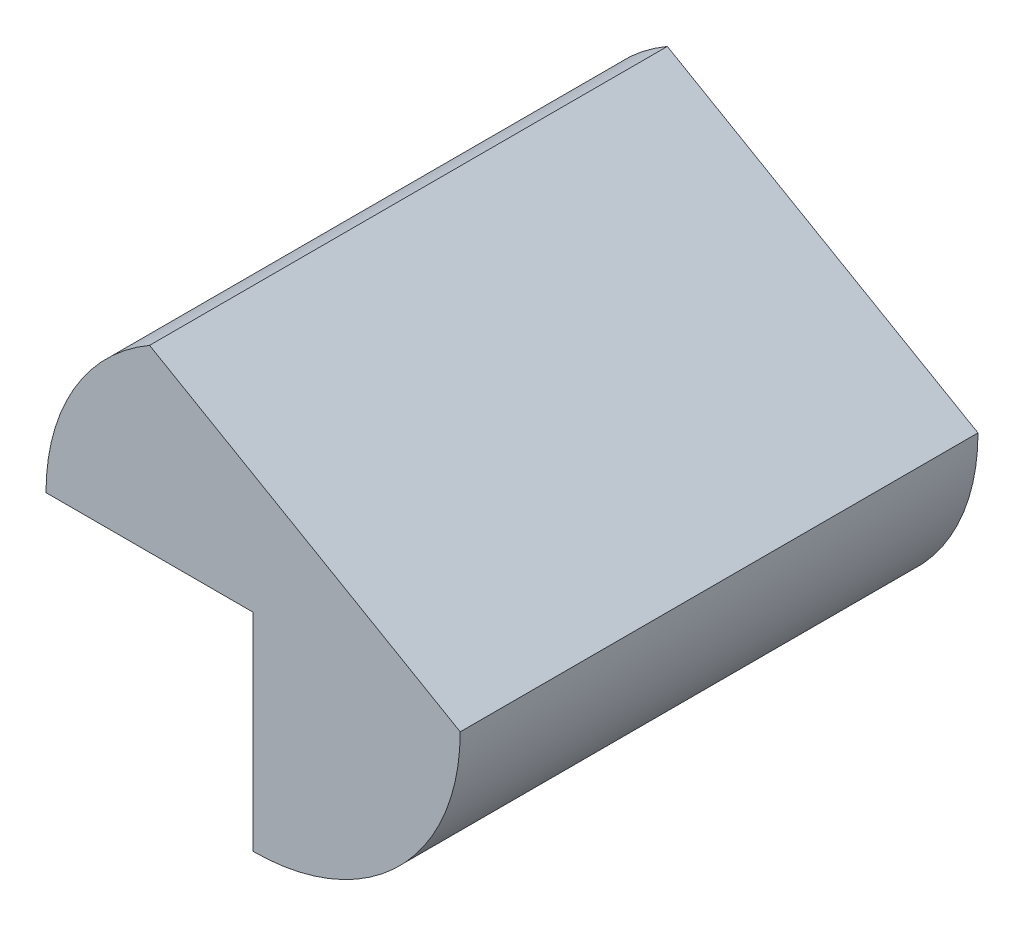
ISO-10303-21;
HEADER;
FILE_DESCRIPTION(('STEP AP214'),'2;1');
FILE_NAME('part.step','',(''),(''),'','','');
FILE_SCHEMA(('AUTOMOTIVE_DESIGN { 1 0 10303 214 1 1 1 1 }'));
ENDSEC;
DATA;
#1=APPLICATION_CONTEXT('core data for automotive mechanical design processes');
#2=APPLICATION_PROTOCOL_DEFINITION('international standard','automotive_design',2000,#1);
#3=PRODUCT_CONTEXT('',#1,'mechanical');
#4=PRODUCT('Part','Part','',(#3));
#5=PRODUCT_RELATED_PRODUCT_CATEGORY('part','',(#4));
#6=PRODUCT_DEFINITION_FORMATION('','',#4);
#7=PRODUCT_DEFINITION_CONTEXT('part definition',#1,'design');
#8=PRODUCT_DEFINITION('design','',#6,#7);
#9=PRODUCT_DEFINITION_SHAPE('','',#8);
#10=(LENGTH_UNIT() NAMED_UNIT(*) SI_UNIT(.MILLI.,.METRE.));
#11=(NAMED_UNIT(*) PLANE_ANGLE_UNIT() SI_UNIT($,.RADIAN.));
#12=(NAMED_UNIT(*) SI_UNIT($,.STERADIAN.) SOLID_ANGLE_UNIT());
#13=UNCERTAINTY_MEASURE_WITH_UNIT(LENGTH_MEASURE(1.E-05),#10,'distance_accuracy_value','');
#14=(GEOMETRIC_REPRESENTATION_CONTEXT(3) GLOBAL_UNCERTAINTY_ASSIGNED_CONTEXT((#13)) GLOBAL_UNIT_ASSIGNED_CONTEXT((#10,
#11,#12)) REPRESENTATION_CONTEXT('',''));
#15=CARTESIAN_POINT('',(0.,0.,0.));
#16=DIRECTION('',(0.,0.,1.));
#17=DIRECTION('',(1.,0.,0.));
#18=AXIS2_PLACEMENT_3D('',#15,#16,#17);
#19=CARTESIAN_POINT('',(0.,0.,25.));
#20=DIRECTION('',(0.,0.,-1.));
#21=DIRECTION('',(-1.,0.,0.));
#22=AXIS2_PLACEMENT_3D('',#19,#20,#21);
#23=CYLINDRICAL_SURFACE('',#22,10.);
#24=CARTESIAN_POINT('',(0.,0.,0.));
#25=DIRECTION('',(0.,0.,1.));
#26=DIRECTION('',(-1.,0.,0.));
#27=AXIS2_PLACEMENT_3D('',#24,#25,#26);
#28=CIRCLE('',#27,10.);
#29=CARTESIAN_POINT('',(-5.,8.66025403784439,0.));
#30=VERTEX_POINT('',#29);
#31=CARTESIAN_POINT('',(-10.,0.,0.));
#32=VERTEX_POINT('',#31);
#33=EDGE_CURVE('E107',#30,#32,#28,.T.);
#34=ORIENTED_EDGE('',*,*,#33,.T.);
#35=DIRECTION('',(0.,0.,-1.));
#36=VECTOR('',#35,1.);
#37=CARTESIAN_POINT('',(-10.,0.,25.));
#38=LINE('',#37,#36);
#39=CARTESIAN_POINT('',(-10.,0.,25.));
#40=VERTEX_POINT('',#39);
#41=EDGE_CURVE('E11',#40,#32,#38,.T.);
#42=ORIENTED_EDGE('',*,*,#41,.F.);
#43=CARTESIAN_POINT('',(0.,0.,25.));
#44=DIRECTION('',(0.,0.,1.));
#45=DIRECTION('',(-1.,0.,0.));
#46=AXIS2_PLACEMENT_3D('',#43,#44,#45);
#47=CIRCLE('',#46,10.);
#48=CARTESIAN_POINT('',(-5.,8.66025403784439,25.));
#49=VERTEX_POINT('',#48);
#50=EDGE_CURVE('E115',#49,#40,#47,.T.);
#51=ORIENTED_EDGE('',*,*,#50,.F.);
#52=DIRECTION('',(0.,0.,-1.));
#53=VECTOR('',#52,1.);
#54=CARTESIAN_POINT('',(-5.,8.66025403784439,25.));
#55=LINE('',#54,#53);
#56=EDGE_CURVE('E103',#49,#30,#55,.T.);
#57=ORIENTED_EDGE('',*,*,#56,.T.);
#58=EDGE_LOOP('',(#34,#42,#51,#57));
#59=FACE_BOUND('',#58,.T.);
#60=ADVANCED_FACE('F33',(#59),#23,.T.);
#61=CARTESIAN_POINT('',(-10.,0.,25.));
#62=DIRECTION('',(0.,1.,0.));
#63=DIRECTION('',(0.,0.,1.));
#64=AXIS2_PLACEMENT_3D('',#61,#62,#63);
#65=PLANE('',#64);
#66=DIRECTION('',(1.,0.,0.));
#67=VECTOR('',#66,1.);
#68=CARTESIAN_POINT('',(-10.,0.,0.));
#69=LINE('',#68,#67);
#70=CARTESIAN_POINT('',(0.,0.,0.));
#71=VERTEX_POINT('',#70);
#72=EDGE_CURVE('E110',#32,#71,#69,.T.);
#73=ORIENTED_EDGE('',*,*,#72,.T.);
#74=DIRECTION('',(0.,0.,-1.));
#75=VECTOR('',#74,1.);
#76=CARTESIAN_POINT('',(0.,0.,25.));
#77=LINE('',#76,#75);
#78=CARTESIAN_POINT('',(0.,0.,25.));
#79=VERTEX_POINT('',#78);
#80=EDGE_CURVE('E41',#79,#71,#77,.T.);
#81=ORIENTED_EDGE('',*,*,#80,.F.);
#82=DIRECTION('',(1.,0.,0.));
#83=VECTOR('',#82,1.);
#84=CARTESIAN_POINT('',(-10.,0.,25.));
#85=LINE('',#84,#83);
#86=EDGE_CURVE('E83',#40,#79,#85,.T.);
#87=ORIENTED_EDGE('',*,*,#86,.F.);
#88=ORIENTED_EDGE('',*,*,#41,.T.);
#89=EDGE_LOOP('',(#73,#81,#87,#88));
#90=FACE_BOUND('',#89,.T.);
#91=ADVANCED_FACE('F134',(#90),#65,.F.);
#92=CARTESIAN_POINT('',(0.,0.,25.));
#93=DIRECTION('',(1.,0.,0.));
#94=DIRECTION('',(0.,1.,0.));
#95=AXIS2_PLACEMENT_3D('',#92,#93,#94);
#96=PLANE('',#95);
#97=DIRECTION('',(0.,-1.,0.));
#98=VECTOR('',#97,1.);
#99=CARTESIAN_POINT('',(0.,0.,0.));
#100=LINE('',#99,#98);
#101=CARTESIAN_POINT('',(0.,-10.,0.));
#102=VERTEX_POINT('',#101);
#103=EDGE_CURVE('E98',#71,#102,#100,.T.);
#104=ORIENTED_EDGE('',*,*,#103,.T.);
#105=DIRECTION('',(0.,0.,-1.));
#106=VECTOR('',#105,1.);
#107=CARTESIAN_POINT('',(0.,-10.,25.));
#108=LINE('',#107,#106);
#109=CARTESIAN_POINT('',(0.,-10.,25.));
#110=VERTEX_POINT('',#109);
#111=EDGE_CURVE('E95',#110,#102,#108,.T.);
#112=ORIENTED_EDGE('',*,*,#111,.F.);
#113=DIRECTION('',(0.,-1.,0.));
#114=VECTOR('',#113,1.);
#115=CARTESIAN_POINT('',(0.,0.,25.));
#116=LINE('',#115,#114);
#117=EDGE_CURVE('E87',#79,#110,#116,.T.);
#118=ORIENTED_EDGE('',*,*,#117,.F.);
#119=ORIENTED_EDGE('',*,*,#80,.T.);
#120=EDGE_LOOP('',(#104,#112,#118,#119));
#121=FACE_BOUND('',#120,.T.);
#122=ADVANCED_FACE('F96',(#121),#96,.F.);
#123=CARTESIAN_POINT('',(0.,0.,25.));
#124=DIRECTION('',(0.,0.,-1.));
#125=DIRECTION('',(-1.,0.,0.));
#126=AXIS2_PLACEMENT_3D('',#123,#124,#125);
#127=CYLINDRICAL_SURFACE('',#126,10.);
#128=CARTESIAN_POINT('',(0.,0.,0.));
#129=DIRECTION('',(0.,0.,1.));
#130=DIRECTION('',(1.,0.,0.));
#131=AXIS2_PLACEMENT_3D('',#128,#129,#130);
#132=CIRCLE('',#131,10.);
#133=CARTESIAN_POINT('',(10.,0.,0.));
#134=VERTEX_POINT('',#133);
#135=EDGE_CURVE('E69',#102,#134,#132,.T.);
#136=ORIENTED_EDGE('',*,*,#135,.T.);
#137=DIRECTION('',(0.,0.,-1.));
#138=VECTOR('',#137,1.);
#139=CARTESIAN_POINT('',(10.,0.,25.));
#140=LINE('',#139,#138);
#141=CARTESIAN_POINT('',(10.,0.,25.));
#142=VERTEX_POINT('',#141);
#143=EDGE_CURVE('E99',#142,#134,#140,.T.);
#144=ORIENTED_EDGE('',*,*,#143,.F.);
#145=CARTESIAN_POINT('',(0.,0.,25.));
#146=DIRECTION('',(0.,0.,1.));
#147=DIRECTION('',(1.,0.,0.));
#148=AXIS2_PLACEMENT_3D('',#145,#146,#147);
#149=CIRCLE('',#148,10.);
#150=EDGE_CURVE('E91',#110,#142,#149,.T.);
#151=ORIENTED_EDGE('',*,*,#150,.F.);
#152=ORIENTED_EDGE('',*,*,#111,.T.);
#153=EDGE_LOOP('',(#136,#144,#151,#152));
#154=FACE_BOUND('',#153,.T.);
#155=ADVANCED_FACE('F101',(#154),#127,.T.);
#156=CARTESIAN_POINT('',(-5.,8.66025403784439,25.));
#157=DIRECTION('',(-0.5,-0.866025403784439,0.));
#158=DIRECTION('',(0.866025403784439,-0.5,0.));
#159=AXIS2_PLACEMENT_3D('',#156,#157,#158);
#160=PLANE('',#159);
#161=DIRECTION('',(-0.866025403784439,0.5,0.));
#162=VECTOR('',#161,1.);
#163=CARTESIAN_POINT('',(-5.,8.66025403784439,0.));
#164=LINE('',#163,#162);
#165=EDGE_CURVE('E75',#134,#30,#164,.T.);
#166=ORIENTED_EDGE('',*,*,#165,.T.);
#167=ORIENTED_EDGE('',*,*,#56,.F.);
#168=DIRECTION('',(-0.866025403784439,0.5,0.));
#169=VECTOR('',#168,1.);
#170=CARTESIAN_POINT('',(-5.,8.66025403784439,25.));
#171=LINE('',#170,#169);
#172=EDGE_CURVE('E49',#142,#49,#171,.T.);
#173=ORIENTED_EDGE('',*,*,#172,.F.);
#174=ORIENTED_EDGE('',*,*,#143,.T.);
#175=EDGE_LOOP('',(#166,#167,#173,#174));
#176=FACE_BOUND('',#175,.T.);
#177=ADVANCED_FACE('F123',(#176),#160,.F.);
#178=CARTESIAN_POINT('',(0.,0.,25.));
#179=DIRECTION('',(0.,0.,-1.));
#180=DIRECTION('',(-1.,0.,0.));
#181=AXIS2_PLACEMENT_3D('',#178,#179,#180);
#182=PLANE('',#181);
#183=ORIENTED_EDGE('',*,*,#50,.T.);
#184=ORIENTED_EDGE('',*,*,#86,.T.);
#185=ORIENTED_EDGE('',*,*,#117,.T.);
#186=ORIENTED_EDGE('',*,*,#150,.T.);
#187=ORIENTED_EDGE('',*,*,#172,.T.);
#188=EDGE_LOOP('',(#183,#184,#185,#186,#187));
#189=FACE_BOUND('',#188,.T.);
#190=ADVANCED_FACE('F89',(#189),#182,.F.);
#191=CARTESIAN_POINT('',(0.,0.,0.));
#192=DIRECTION('',(0.,0.,-1.));
#193=DIRECTION('',(-1.,0.,0.));
#194=AXIS2_PLACEMENT_3D('',#191,#192,#193);
#195=PLANE('',#194);
#196=ORIENTED_EDGE('',*,*,#33,.F.);
#197=ORIENTED_EDGE('',*,*,#165,.F.);
#198=ORIENTED_EDGE('',*,*,#135,.F.);
#199=ORIENTED_EDGE('',*,*,#103,.F.);
#200=ORIENTED_EDGE('',*,*,#72,.F.);
#201=EDGE_LOOP('',(#196,#197,#198,#199,#200));
#202=FACE_BOUND('',#201,.T.);
#203=ADVANCED_FACE('F119',(#202),#195,.T.);
#204=CLOSED_SHELL('',(#60,#91,#122,#155,#177,#190,#203));
#205=MANIFOLD_SOLID_BREP('B2',#204);
#206=ADVANCED_BREP_SHAPE_REPRESENTATION('',(#18,#205),#14);
#207=SHAPE_DEFINITION_REPRESENTATION(#9,#206);
ENDSEC;
END-ISO-10303-21;
